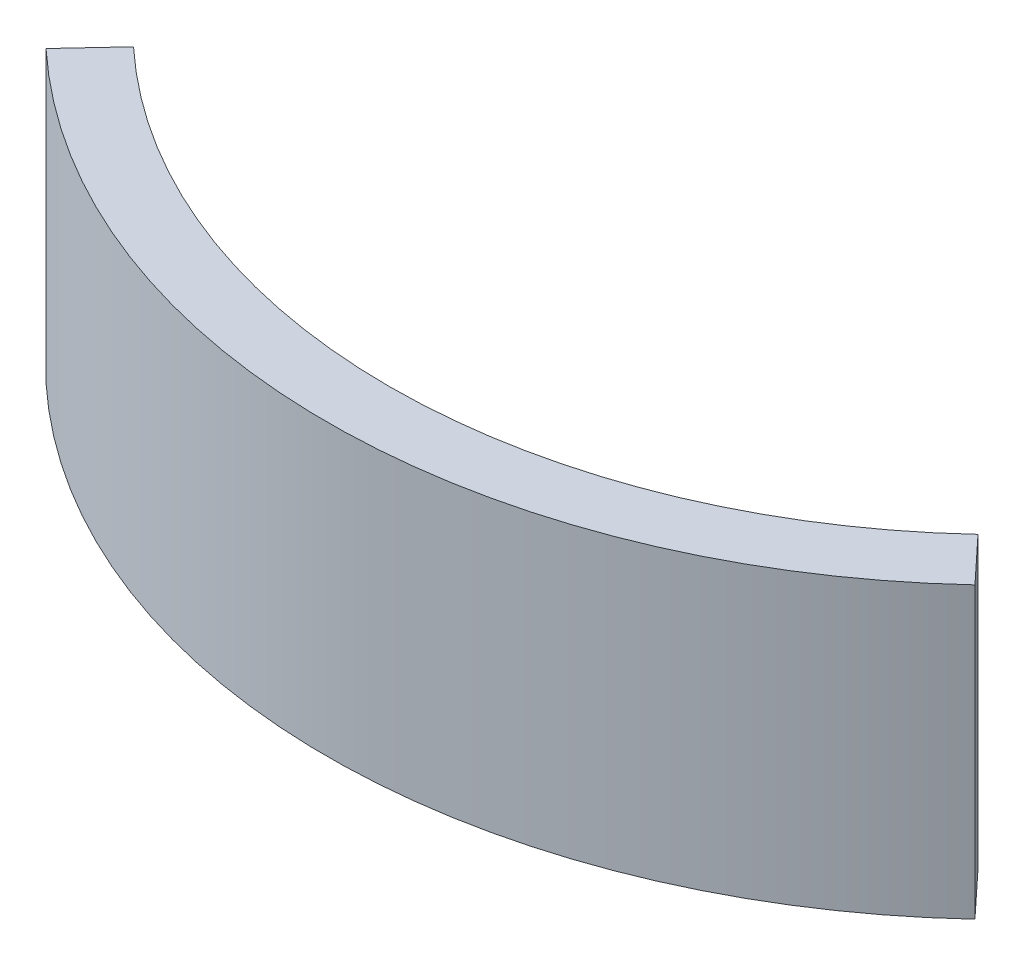
ISO-10303-21;
HEADER;
FILE_DESCRIPTION(('STEP AP214'),'2;1');
FILE_NAME('part.step','',(''),(''),'','','');
FILE_SCHEMA(('AUTOMOTIVE_DESIGN { 1 0 10303 214 1 1 1 1 }'));
ENDSEC;
DATA;
#1=APPLICATION_CONTEXT('core data for automotive mechanical design processes');
#2=APPLICATION_PROTOCOL_DEFINITION('international standard','automotive_design',2000,#1);
#3=PRODUCT_CONTEXT('',#1,'mechanical');
#4=PRODUCT('Part','Part','',(#3));
#5=PRODUCT_RELATED_PRODUCT_CATEGORY('part','',(#4));
#6=PRODUCT_DEFINITION_FORMATION('','',#4);
#7=PRODUCT_DEFINITION_CONTEXT('part definition',#1,'design');
#8=PRODUCT_DEFINITION('design','',#6,#7);
#9=PRODUCT_DEFINITION_SHAPE('','',#8);
#10=(LENGTH_UNIT() NAMED_UNIT(*) SI_UNIT(.MILLI.,.METRE.));
#11=(NAMED_UNIT(*) PLANE_ANGLE_UNIT() SI_UNIT($,.RADIAN.));
#12=(NAMED_UNIT(*) SI_UNIT($,.STERADIAN.) SOLID_ANGLE_UNIT());
#13=UNCERTAINTY_MEASURE_WITH_UNIT(LENGTH_MEASURE(1.E-05),#10,'distance_accuracy_value','');
#14=(GEOMETRIC_REPRESENTATION_CONTEXT(3) GLOBAL_UNCERTAINTY_ASSIGNED_CONTEXT((#13)) GLOBAL_UNIT_ASSIGNED_CONTEXT((#10,
#11,#12)) REPRESENTATION_CONTEXT('',''));
#15=CARTESIAN_POINT('',(0.,0.,0.));
#16=DIRECTION('',(0.,0.,1.));
#17=DIRECTION('',(1.,0.,0.));
#18=AXIS2_PLACEMENT_3D('',#15,#16,#17);
#19=CARTESIAN_POINT('',(0.,6.08,-14.3));
#20=DIRECTION('',(0.,-1.,0.));
#21=DIRECTION('',(0.,0.,-1.));
#22=AXIS2_PLACEMENT_3D('',#19,#20,#21);
#23=CYLINDRICAL_SURFACE('',#22,14.3);
#24=CARTESIAN_POINT('',(0.,0.,-14.3));
#25=DIRECTION('',(0.,1.,0.));
#26=DIRECTION('',(0.,0.,1.));
#27=AXIS2_PLACEMENT_3D('',#24,#25,#26);
#28=CIRCLE('',#27,14.3);
#29=CARTESIAN_POINT('',(-9.75257654889374,0.,-3.84164206684588));
#30=VERTEX_POINT('',#29);
#31=CARTESIAN_POINT('',(9.75257654889375,0.,-3.84164206684588));
#32=VERTEX_POINT('',#31);
#33=EDGE_CURVE('E98',#30,#32,#28,.T.);
#34=ORIENTED_EDGE('',*,*,#33,.T.);
#35=DIRECTION('',(0.,-1.,0.));
#36=VECTOR('',#35,1.);
#37=CARTESIAN_POINT('',(9.75257654889375,6.08,-3.84164206684588));
#38=LINE('',#37,#36);
#39=CARTESIAN_POINT('',(9.75257654889375,6.08,-3.84164206684588));
#40=VERTEX_POINT('',#39);
#41=EDGE_CURVE('E11',#40,#32,#38,.T.);
#42=ORIENTED_EDGE('',*,*,#41,.F.);
#43=CARTESIAN_POINT('',(0.,6.08,-14.3));
#44=DIRECTION('',(0.,1.,0.));
#45=DIRECTION('',(0.,0.,1.));
#46=AXIS2_PLACEMENT_3D('',#43,#44,#45);
#47=CIRCLE('',#46,14.3);
#48=CARTESIAN_POINT('',(-9.75257654889374,6.08,-3.84164206684588));
#49=VERTEX_POINT('',#48);
#50=EDGE_CURVE('E86',#49,#40,#47,.T.);
#51=ORIENTED_EDGE('',*,*,#50,.F.);
#52=DIRECTION('',(0.,-1.,0.));
#53=VECTOR('',#52,1.);
#54=CARTESIAN_POINT('',(-9.75257654889374,6.08,-3.84164206684588));
#55=LINE('',#54,#53);
#56=EDGE_CURVE('E94',#49,#30,#55,.T.);
#57=ORIENTED_EDGE('',*,*,#56,.T.);
#58=EDGE_LOOP('',(#34,#42,#51,#57));
#59=FACE_BOUND('',#58,.T.);
#60=ADVANCED_FACE('F35',(#59),#23,.T.);
#61=CARTESIAN_POINT('',(9.75257654889375,6.08,-3.84164206684588));
#62=DIRECTION('',(-0.73135370161917,0.,0.681998360062499));
#63=DIRECTION('',(0.681998360062499,0.,0.73135370161917));
#64=AXIS2_PLACEMENT_3D('',#61,#62,#63);
#65=PLANE('',#64);
#66=DIRECTION('',(-0.681998360062499,0.,-0.73135370161917));
#67=VECTOR('',#66,1.);
#68=CARTESIAN_POINT('',(9.75257654889375,0.,-3.84164206684588));
#69=LINE('',#68,#67);
#70=CARTESIAN_POINT('',(8.8659786808125,0.,-4.79240187895079));
#71=VERTEX_POINT('',#70);
#72=EDGE_CURVE('E90',#32,#71,#69,.T.);
#73=ORIENTED_EDGE('',*,*,#72,.T.);
#74=DIRECTION('',(0.,-1.,0.));
#75=VECTOR('',#74,1.);
#76=CARTESIAN_POINT('',(8.8659786808125,6.08,-4.79240187895079));
#77=LINE('',#76,#75);
#78=CARTESIAN_POINT('',(8.8659786808125,6.08,-4.79240187895079));
#79=VERTEX_POINT('',#78);
#80=EDGE_CURVE('E43',#79,#71,#77,.T.);
#81=ORIENTED_EDGE('',*,*,#80,.F.);
#82=DIRECTION('',(-0.681998360062499,0.,-0.73135370161917));
#83=VECTOR('',#82,1.);
#84=CARTESIAN_POINT('',(9.75257654889375,6.08,-3.84164206684588));
#85=LINE('',#84,#83);
#86=EDGE_CURVE('E81',#40,#79,#85,.T.);
#87=ORIENTED_EDGE('',*,*,#86,.F.);
#88=ORIENTED_EDGE('',*,*,#41,.T.);
#89=EDGE_LOOP('',(#73,#81,#87,#88));
#90=FACE_BOUND('',#89,.T.);
#91=ADVANCED_FACE('F89',(#90),#65,.F.);
#92=CARTESIAN_POINT('',(0.,6.08,-14.3));
#93=DIRECTION('',(0.,-1.,0.));
#94=DIRECTION('',(0.,0.,-1.));
#95=AXIS2_PLACEMENT_3D('',#92,#93,#94);
#96=CYLINDRICAL_SURFACE('',#95,13.);
#97=CARTESIAN_POINT('',(0.,0.,-14.3));
#98=DIRECTION('',(0.,-1.,0.));
#99=DIRECTION('',(0.,0.,1.));
#100=AXIS2_PLACEMENT_3D('',#97,#98,#99);
#101=CIRCLE('',#100,13.);
#102=CARTESIAN_POINT('',(-8.8659786808125,0.,-4.7924018789508));
#103=VERTEX_POINT('',#102);
#104=EDGE_CURVE('E68',#71,#103,#101,.T.);
#105=ORIENTED_EDGE('',*,*,#104,.T.);
#106=DIRECTION('',(0.,-1.,0.));
#107=VECTOR('',#106,1.);
#108=CARTESIAN_POINT('',(-8.8659786808125,6.08,-4.7924018789508));
#109=LINE('',#108,#107);
#110=CARTESIAN_POINT('',(-8.8659786808125,6.08,-4.7924018789508));
#111=VERTEX_POINT('',#110);
#112=EDGE_CURVE('E91',#111,#103,#109,.T.);
#113=ORIENTED_EDGE('',*,*,#112,.F.);
#114=CARTESIAN_POINT('',(0.,6.08,-14.3));
#115=DIRECTION('',(0.,-1.,0.));
#116=DIRECTION('',(0.,0.,1.));
#117=AXIS2_PLACEMENT_3D('',#114,#115,#116);
#118=CIRCLE('',#117,13.);
#119=EDGE_CURVE('E84',#79,#111,#118,.T.);
#120=ORIENTED_EDGE('',*,*,#119,.F.);
#121=ORIENTED_EDGE('',*,*,#80,.T.);
#122=EDGE_LOOP('',(#105,#113,#120,#121));
#123=FACE_BOUND('',#122,.T.);
#124=ADVANCED_FACE('F92',(#123),#96,.F.);
#125=CARTESIAN_POINT('',(-8.8659786808125,6.08,-4.7924018789508));
#126=DIRECTION('',(0.73135370161917,0.,0.681998360062499));
#127=DIRECTION('',(0.681998360062499,0.,-0.73135370161917));
#128=AXIS2_PLACEMENT_3D('',#125,#126,#127);
#129=PLANE('',#128);
#130=DIRECTION('',(-0.681998360062499,0.,0.73135370161917));
#131=VECTOR('',#130,1.);
#132=CARTESIAN_POINT('',(-8.8659786808125,0.,-4.7924018789508));
#133=LINE('',#132,#131);
#134=EDGE_CURVE('E74',#103,#30,#133,.T.);
#135=ORIENTED_EDGE('',*,*,#134,.T.);
#136=ORIENTED_EDGE('',*,*,#56,.F.);
#137=DIRECTION('',(-0.681998360062499,0.,0.73135370161917));
#138=VECTOR('',#137,1.);
#139=CARTESIAN_POINT('',(-8.8659786808125,6.08,-4.7924018789508));
#140=LINE('',#139,#138);
#141=EDGE_CURVE('E51',#111,#49,#140,.T.);
#142=ORIENTED_EDGE('',*,*,#141,.F.);
#143=ORIENTED_EDGE('',*,*,#112,.T.);
#144=EDGE_LOOP('',(#135,#136,#142,#143));
#145=FACE_BOUND('',#144,.T.);
#146=ADVANCED_FACE('F105',(#145),#129,.F.);
#147=CARTESIAN_POINT('',(0.,6.08,-14.3));
#148=DIRECTION('',(0.,1.,0.));
#149=DIRECTION('',(0.,0.,1.));
#150=AXIS2_PLACEMENT_3D('',#147,#148,#149);
#151=PLANE('',#150);
#152=ORIENTED_EDGE('',*,*,#50,.T.);
#153=ORIENTED_EDGE('',*,*,#86,.T.);
#154=ORIENTED_EDGE('',*,*,#119,.T.);
#155=ORIENTED_EDGE('',*,*,#141,.T.);
#156=EDGE_LOOP('',(#152,#153,#154,#155));
#157=FACE_BOUND('',#156,.T.);
#158=ADVANCED_FACE('F82',(#157),#151,.T.);
#159=CARTESIAN_POINT('',(0.,0.,-14.3));
#160=DIRECTION('',(0.,1.,0.));
#161=DIRECTION('',(0.,0.,1.));
#162=AXIS2_PLACEMENT_3D('',#159,#160,#161);
#163=PLANE('',#162);
#164=ORIENTED_EDGE('',*,*,#33,.F.);
#165=ORIENTED_EDGE('',*,*,#134,.F.);
#166=ORIENTED_EDGE('',*,*,#104,.F.);
#167=ORIENTED_EDGE('',*,*,#72,.F.);
#168=EDGE_LOOP('',(#164,#165,#166,#167));
#169=FACE_BOUND('',#168,.T.);
#170=ADVANCED_FACE('F108',(#169),#163,.F.);
#171=CLOSED_SHELL('',(#60,#91,#124,#146,#158,#170));
#172=MANIFOLD_SOLID_BREP('B2',#171);
#173=ADVANCED_BREP_SHAPE_REPRESENTATION('',(#18,#172),#14);
#174=SHAPE_DEFINITION_REPRESENTATION(#9,#173);
ENDSEC;
END-ISO-10303-21;
